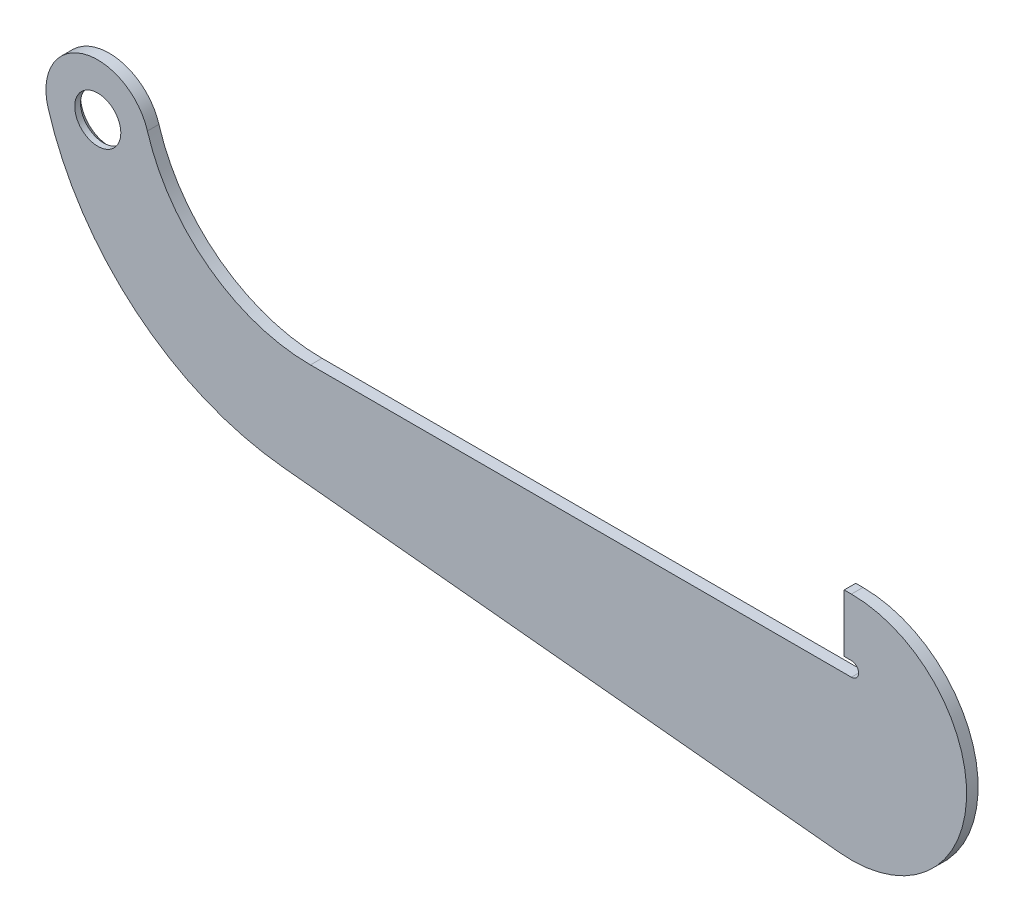
ISO-10303-21;
HEADER;
FILE_DESCRIPTION(('STEP AP214'),'2;1');
FILE_NAME('part.step','',(''),(''),'','','');
FILE_SCHEMA(('AUTOMOTIVE_DESIGN { 1 0 10303 214 1 1 1 1 }'));
ENDSEC;
DATA;
#1=APPLICATION_CONTEXT('core data for automotive mechanical design processes');
#2=APPLICATION_PROTOCOL_DEFINITION('international standard','automotive_design',2000,#1);
#3=PRODUCT_CONTEXT('',#1,'mechanical');
#4=PRODUCT('Part','Part','',(#3));
#5=PRODUCT_RELATED_PRODUCT_CATEGORY('part','',(#4));
#6=PRODUCT_DEFINITION_FORMATION('','',#4);
#7=PRODUCT_DEFINITION_CONTEXT('part definition',#1,'design');
#8=PRODUCT_DEFINITION('design','',#6,#7);
#9=PRODUCT_DEFINITION_SHAPE('','',#8);
#10=(LENGTH_UNIT() NAMED_UNIT(*) SI_UNIT(.MILLI.,.METRE.));
#11=(NAMED_UNIT(*) PLANE_ANGLE_UNIT() SI_UNIT($,.RADIAN.));
#12=(NAMED_UNIT(*) SI_UNIT($,.STERADIAN.) SOLID_ANGLE_UNIT());
#13=UNCERTAINTY_MEASURE_WITH_UNIT(LENGTH_MEASURE(1.E-05),#10,'distance_accuracy_value','');
#14=(GEOMETRIC_REPRESENTATION_CONTEXT(3) GLOBAL_UNCERTAINTY_ASSIGNED_CONTEXT((#13)) GLOBAL_UNIT_ASSIGNED_CONTEXT((#10,
#11,#12)) REPRESENTATION_CONTEXT('',''));
#15=CARTESIAN_POINT('',(0.,0.,0.));
#16=DIRECTION('',(0.,0.,1.));
#17=DIRECTION('',(1.,0.,0.));
#18=AXIS2_PLACEMENT_3D('',#15,#16,#17);
#19=CARTESIAN_POINT('',(261.653254994771,-34.3149545762237,4.));
#20=DIRECTION('',(0.,0.,1.));
#21=DIRECTION('',(1.,0.,0.));
#22=AXIS2_PLACEMENT_3D('',#19,#20,#21);
#23=PLANE('',#22);
#24=DIRECTION('',(0.,-1.,0.));
#25=VECTOR('',#24,1.);
#26=CARTESIAN_POINT('',(259.153254994771,-11.8149545762237,4.));
#27=LINE('',#26,#25);
#28=CARTESIAN_POINT('',(259.153254994771,-11.8149545762237,4.));
#29=VERTEX_POINT('',#28);
#30=CARTESIAN_POINT('',(259.153254994771,-31.8149545762237,4.));
#31=VERTEX_POINT('',#30);
#32=EDGE_CURVE('E167',#29,#31,#27,.T.);
#33=ORIENTED_EDGE('',*,*,#32,.T.);
#34=DIRECTION('',(1.,0.,0.));
#35=VECTOR('',#34,1.);
#36=CARTESIAN_POINT('',(259.153254994771,-31.8149545762237,4.));
#37=LINE('',#36,#35);
#38=CARTESIAN_POINT('',(261.653254994771,-31.8149545762237,4.));
#39=VERTEX_POINT('',#38);
#40=EDGE_CURVE('E105',#31,#39,#37,.T.);
#41=ORIENTED_EDGE('',*,*,#40,.T.);
#42=CARTESIAN_POINT('',(261.653254994771,-34.3149545762237,4.));
#43=DIRECTION('',(0.,0.,-1.));
#44=DIRECTION('',(1.,0.,0.));
#45=AXIS2_PLACEMENT_3D('',#42,#43,#44);
#46=CIRCLE('',#45,2.50000000000001);
#47=CARTESIAN_POINT('',(261.653254994771,-36.8149545762238,4.));
#48=VERTEX_POINT('',#47);
#49=EDGE_CURVE('E250',#39,#48,#46,.T.);
#50=ORIENTED_EDGE('',*,*,#49,.T.);
#51=DIRECTION('',(-1.,0.,0.));
#52=VECTOR('',#51,1.);
#53=CARTESIAN_POINT('',(261.653254994771,-36.8149545762238,4.));
#54=LINE('',#53,#52);
#55=CARTESIAN_POINT('',(73.8381712348275,-36.8149545762238,4.));
#56=VERTEX_POINT('',#55);
#57=EDGE_CURVE('E252',#48,#56,#54,.T.);
#58=ORIENTED_EDGE('',*,*,#57,.T.);
#59=CARTESIAN_POINT('',(73.8381712348275,22.324165960103,4.));
#60=DIRECTION('',(0.,0.,-1.));
#61=DIRECTION('',(-1.,0.,0.));
#62=AXIS2_PLACEMENT_3D('',#59,#60,#61);
#63=CIRCLE('',#62,59.1391205363268);
#64=CARTESIAN_POINT('',(17.2297411869115,5.20922437912188,4.));
#65=VERTEX_POINT('',#64);
#66=EDGE_CURVE('E254',#56,#65,#63,.T.);
#67=ORIENTED_EDGE('',*,*,#66,.T.);
#68=CARTESIAN_POINT('',(-2.77555756156289E-13,0.,4.));
#69=DIRECTION('',(0.,0.,1.));
#70=DIRECTION('',(1.,0.,0.));
#71=AXIS2_PLACEMENT_3D('',#68,#69,#70);
#72=CIRCLE('',#71,18.);
#73=CARTESIAN_POINT('',(-17.229741186912,-5.20922437912183,4.));
#74=VERTEX_POINT('',#73);
#75=EDGE_CURVE('E260',#65,#74,#72,.T.);
#76=ORIENTED_EDGE('',*,*,#75,.T.);
#77=CARTESIAN_POINT('',(73.8381712348275,22.324165960103,4.));
#78=DIRECTION('',(0.,0.,1.));
#79=DIRECTION('',(1.,0.,0.));
#80=AXIS2_PLACEMENT_3D('',#77,#78,#79);
#81=CIRCLE('',#80,95.1391205363269);
#82=CARTESIAN_POINT('',(64.3988822191728,-72.3455339406819,4.));
#83=VERTEX_POINT('',#82);
#84=EDGE_CURVE('E130',#74,#83,#81,.T.);
#85=ORIENTED_EDGE('',*,*,#84,.T.);
#86=DIRECTION('',(0.995065955698395,-0.0992156429704483,0.));
#87=VECTOR('',#86,1.);
#88=CARTESIAN_POINT('',(257.684629275953,-91.6175928041593,4.));
#89=LINE('',#88,#87);
#90=CARTESIAN_POINT('',(257.684629275953,-91.6175928041593,4.));
#91=VERTEX_POINT('',#90);
#92=EDGE_CURVE('E124',#83,#91,#89,.T.);
#93=ORIENTED_EDGE('',*,*,#92,.T.);
#94=CARTESIAN_POINT('',(261.653254994771,-51.8149545762236,4.));
#95=DIRECTION('',(0.,0.,1.));
#96=DIRECTION('',(1.,0.,0.));
#97=AXIS2_PLACEMENT_3D('',#94,#95,#96);
#98=CIRCLE('',#97,39.9999999999999);
#99=CARTESIAN_POINT('',(261.653254994771,-11.8149545762237,4.));
#100=VERTEX_POINT('',#99);
#101=EDGE_CURVE('E128',#91,#100,#98,.T.);
#102=ORIENTED_EDGE('',*,*,#101,.T.);
#103=DIRECTION('',(-1.,0.,0.));
#104=VECTOR('',#103,1.);
#105=CARTESIAN_POINT('',(259.153254994771,-11.8149545762237,4.));
#106=LINE('',#105,#104);
#107=EDGE_CURVE('E55',#100,#29,#106,.T.);
#108=ORIENTED_EDGE('',*,*,#107,.T.);
#109=EDGE_LOOP('',(#33,#41,#50,#58,#67,#76,#85,#93,#102,#108));
#110=FACE_BOUND('',#109,.T.);
#111=CARTESIAN_POINT('',(-2.77555756156289E-13,0.,4.));
#112=DIRECTION('',(0.,0.,1.));
#113=DIRECTION('',(1.,0.,0.));
#114=AXIS2_PLACEMENT_3D('',#111,#112,#113);
#115=CIRCLE('',#114,7.99999999999998);
#116=CARTESIAN_POINT('',(7.99999999999971,0.,4.));
#117=VERTEX_POINT('',#116);
#118=EDGE_CURVE('E152',#117,#117,#115,.T.);
#119=ORIENTED_EDGE('',*,*,#118,.F.);
#120=EDGE_LOOP('',(#119));
#121=FACE_BOUND('',#120,.T.);
#122=ADVANCED_FACE('F38',(#110,#121),#23,.T.);
#123=CARTESIAN_POINT('',(261.653254994771,-34.3149545762237,0.));
#124=DIRECTION('',(0.,0.,1.));
#125=DIRECTION('',(1.,0.,0.));
#126=AXIS2_PLACEMENT_3D('',#123,#124,#125);
#127=PLANE('',#126);
#128=CARTESIAN_POINT('',(-2.77555756156289E-13,0.,0.));
#129=DIRECTION('',(0.,0.,1.));
#130=DIRECTION('',(1.,0.,0.));
#131=AXIS2_PLACEMENT_3D('',#128,#129,#130);
#132=CIRCLE('',#131,9.99999999999995);
#133=CARTESIAN_POINT('',(9.99999999999968,0.,0.));
#134=VERTEX_POINT('',#133);
#135=EDGE_CURVE('E47',#134,#134,#132,.T.);
#136=ORIENTED_EDGE('',*,*,#135,.T.);
#137=EDGE_LOOP('',(#136));
#138=FACE_BOUND('',#137,.T.);
#139=DIRECTION('',(0.,-1.,0.));
#140=VECTOR('',#139,1.);
#141=CARTESIAN_POINT('',(259.153254994771,-11.8149545762237,0.));
#142=LINE('',#141,#140);
#143=CARTESIAN_POINT('',(259.153254994771,-11.8149545762237,0.));
#144=VERTEX_POINT('',#143);
#145=CARTESIAN_POINT('',(259.153254994771,-31.8149545762237,0.));
#146=VERTEX_POINT('',#145);
#147=EDGE_CURVE('E148',#144,#146,#142,.T.);
#148=ORIENTED_EDGE('',*,*,#147,.F.);
#149=DIRECTION('',(-1.,0.,0.));
#150=VECTOR('',#149,1.);
#151=CARTESIAN_POINT('',(259.153254994771,-11.8149545762237,0.));
#152=LINE('',#151,#150);
#153=CARTESIAN_POINT('',(261.653254994771,-11.8149545762237,0.));
#154=VERTEX_POINT('',#153);
#155=EDGE_CURVE('E96',#154,#144,#152,.T.);
#156=ORIENTED_EDGE('',*,*,#155,.F.);
#157=CARTESIAN_POINT('',(261.653254994771,-51.8149545762236,0.));
#158=DIRECTION('',(0.,0.,1.));
#159=DIRECTION('',(1.,0.,0.));
#160=AXIS2_PLACEMENT_3D('',#157,#158,#159);
#161=CIRCLE('',#160,39.9999999999999);
#162=CARTESIAN_POINT('',(257.684629275953,-91.6175928041593,0.));
#163=VERTEX_POINT('',#162);
#164=EDGE_CURVE('E90',#163,#154,#161,.T.);
#165=ORIENTED_EDGE('',*,*,#164,.F.);
#166=DIRECTION('',(0.995065955698395,-0.0992156429704483,0.));
#167=VECTOR('',#166,1.);
#168=CARTESIAN_POINT('',(257.684629275953,-91.6175928041593,0.));
#169=LINE('',#168,#167);
#170=CARTESIAN_POINT('',(64.3988822191728,-72.3455339406819,0.));
#171=VERTEX_POINT('',#170);
#172=EDGE_CURVE('E138',#171,#163,#169,.T.);
#173=ORIENTED_EDGE('',*,*,#172,.F.);
#174=CARTESIAN_POINT('',(73.8381712348275,22.324165960103,0.));
#175=DIRECTION('',(0.,0.,1.));
#176=DIRECTION('',(1.,0.,0.));
#177=AXIS2_PLACEMENT_3D('',#174,#175,#176);
#178=CIRCLE('',#177,95.1391205363269);
#179=CARTESIAN_POINT('',(-17.229741186912,-5.20922437912183,0.));
#180=VERTEX_POINT('',#179);
#181=EDGE_CURVE('E162',#180,#171,#178,.T.);
#182=ORIENTED_EDGE('',*,*,#181,.F.);
#183=CARTESIAN_POINT('',(-2.77555756156289E-13,0.,0.));
#184=DIRECTION('',(0.,0.,1.));
#185=DIRECTION('',(1.,0.,0.));
#186=AXIS2_PLACEMENT_3D('',#183,#184,#185);
#187=CIRCLE('',#186,18.);
#188=CARTESIAN_POINT('',(17.2297411869115,5.20922437912188,0.));
#189=VERTEX_POINT('',#188);
#190=EDGE_CURVE('E160',#189,#180,#187,.T.);
#191=ORIENTED_EDGE('',*,*,#190,.F.);
#192=CARTESIAN_POINT('',(73.8381712348275,22.324165960103,0.));
#193=DIRECTION('',(0.,0.,-1.));
#194=DIRECTION('',(-1.,0.,0.));
#195=AXIS2_PLACEMENT_3D('',#192,#193,#194);
#196=CIRCLE('',#195,59.1391205363268);
#197=CARTESIAN_POINT('',(73.8381712348275,-36.8149545762238,0.));
#198=VERTEX_POINT('',#197);
#199=EDGE_CURVE('E158',#198,#189,#196,.T.);
#200=ORIENTED_EDGE('',*,*,#199,.F.);
#201=DIRECTION('',(-1.,0.,0.));
#202=VECTOR('',#201,1.);
#203=CARTESIAN_POINT('',(261.653254994771,-36.8149545762238,0.));
#204=LINE('',#203,#202);
#205=CARTESIAN_POINT('',(261.653254994771,-36.8149545762238,0.));
#206=VERTEX_POINT('',#205);
#207=EDGE_CURVE('E156',#206,#198,#204,.T.);
#208=ORIENTED_EDGE('',*,*,#207,.F.);
#209=CARTESIAN_POINT('',(261.653254994771,-34.3149545762237,0.));
#210=DIRECTION('',(0.,0.,-1.));
#211=DIRECTION('',(1.,0.,0.));
#212=AXIS2_PLACEMENT_3D('',#209,#210,#211);
#213=CIRCLE('',#212,2.50000000000001);
#214=CARTESIAN_POINT('',(261.653254994771,-31.8149545762237,0.));
#215=VERTEX_POINT('',#214);
#216=EDGE_CURVE('E154',#215,#206,#213,.T.);
#217=ORIENTED_EDGE('',*,*,#216,.F.);
#218=DIRECTION('',(1.,0.,0.));
#219=VECTOR('',#218,1.);
#220=CARTESIAN_POINT('',(259.153254994771,-31.8149545762237,0.));
#221=LINE('',#220,#219);
#222=EDGE_CURVE('E151',#146,#215,#221,.T.);
#223=ORIENTED_EDGE('',*,*,#222,.F.);
#224=EDGE_LOOP('',(#148,#156,#165,#173,#182,#191,#200,#208,#217,#223));
#225=FACE_BOUND('',#224,.T.);
#226=ADVANCED_FACE('F190',(#138,#225),#127,.F.);
#227=CARTESIAN_POINT('',(259.153254994771,-11.8149545762237,4.));
#228=DIRECTION('',(1.,0.,0.));
#229=DIRECTION('',(0.,0.,-1.));
#230=AXIS2_PLACEMENT_3D('',#227,#228,#229);
#231=PLANE('',#230);
#232=ORIENTED_EDGE('',*,*,#147,.T.);
#233=DIRECTION('',(0.,0.,-1.));
#234=VECTOR('',#233,1.);
#235=CARTESIAN_POINT('',(259.153254994771,-31.8149545762237,4.));
#236=LINE('',#235,#234);
#237=EDGE_CURVE('E186',#31,#146,#236,.T.);
#238=ORIENTED_EDGE('',*,*,#237,.F.);
#239=ORIENTED_EDGE('',*,*,#32,.F.);
#240=DIRECTION('',(0.,0.,-1.));
#241=VECTOR('',#240,1.);
#242=CARTESIAN_POINT('',(259.153254994771,-11.8149545762237,4.));
#243=LINE('',#242,#241);
#244=EDGE_CURVE('E144',#29,#144,#243,.T.);
#245=ORIENTED_EDGE('',*,*,#244,.T.);
#246=EDGE_LOOP('',(#232,#238,#239,#245));
#247=FACE_BOUND('',#246,.T.);
#248=ADVANCED_FACE('F208',(#247),#231,.F.);
#249=CARTESIAN_POINT('',(259.153254994771,-31.8149545762237,4.));
#250=DIRECTION('',(0.,1.,0.));
#251=DIRECTION('',(-1.,0.,0.));
#252=AXIS2_PLACEMENT_3D('',#249,#250,#251);
#253=PLANE('',#252);
#254=ORIENTED_EDGE('',*,*,#222,.T.);
#255=DIRECTION('',(0.,0.,-1.));
#256=VECTOR('',#255,1.);
#257=CARTESIAN_POINT('',(261.653254994771,-31.8149545762237,4.));
#258=LINE('',#257,#256);
#259=EDGE_CURVE('E183',#39,#215,#258,.T.);
#260=ORIENTED_EDGE('',*,*,#259,.F.);
#261=ORIENTED_EDGE('',*,*,#40,.F.);
#262=ORIENTED_EDGE('',*,*,#237,.T.);
#263=EDGE_LOOP('',(#254,#260,#261,#262));
#264=FACE_BOUND('',#263,.T.);
#265=ADVANCED_FACE('F236',(#264),#253,.F.);
#266=CARTESIAN_POINT('',(261.653254994771,-34.3149545762237,4.));
#267=DIRECTION('',(0.,0.,-1.));
#268=DIRECTION('',(-1.,0.,0.));
#269=AXIS2_PLACEMENT_3D('',#266,#267,#268);
#270=CYLINDRICAL_SURFACE('',#269,2.50000000000001);
#271=ORIENTED_EDGE('',*,*,#216,.T.);
#272=DIRECTION('',(0.,0.,-1.));
#273=VECTOR('',#272,1.);
#274=CARTESIAN_POINT('',(261.653254994771,-36.8149545762238,4.));
#275=LINE('',#274,#273);
#276=EDGE_CURVE('E180',#48,#206,#275,.T.);
#277=ORIENTED_EDGE('',*,*,#276,.F.);
#278=ORIENTED_EDGE('',*,*,#49,.F.);
#279=ORIENTED_EDGE('',*,*,#259,.T.);
#280=EDGE_LOOP('',(#271,#277,#278,#279));
#281=FACE_BOUND('',#280,.T.);
#282=ADVANCED_FACE('F232',(#281),#270,.F.);
#283=CARTESIAN_POINT('',(261.653254994771,-36.8149545762238,4.));
#284=DIRECTION('',(0.,-1.,0.));
#285=DIRECTION('',(1.,0.,0.));
#286=AXIS2_PLACEMENT_3D('',#283,#284,#285);
#287=PLANE('',#286);
#288=ORIENTED_EDGE('',*,*,#207,.T.);
#289=DIRECTION('',(0.,0.,-1.));
#290=VECTOR('',#289,1.);
#291=CARTESIAN_POINT('',(73.8381712348275,-36.8149545762238,4.));
#292=LINE('',#291,#290);
#293=EDGE_CURVE('E177',#56,#198,#292,.T.);
#294=ORIENTED_EDGE('',*,*,#293,.F.);
#295=ORIENTED_EDGE('',*,*,#57,.F.);
#296=ORIENTED_EDGE('',*,*,#276,.T.);
#297=EDGE_LOOP('',(#288,#294,#295,#296));
#298=FACE_BOUND('',#297,.T.);
#299=ADVANCED_FACE('F228',(#298),#287,.F.);
#300=CARTESIAN_POINT('',(73.8381712348275,22.324165960103,4.));
#301=DIRECTION('',(0.,0.,-1.));
#302=DIRECTION('',(-1.,0.,0.));
#303=AXIS2_PLACEMENT_3D('',#300,#301,#302);
#304=CYLINDRICAL_SURFACE('',#303,59.1391205363268);
#305=ORIENTED_EDGE('',*,*,#199,.T.);
#306=DIRECTION('',(0.,0.,-1.));
#307=VECTOR('',#306,1.);
#308=CARTESIAN_POINT('',(17.2297411869115,5.20922437912188,4.));
#309=LINE('',#308,#307);
#310=EDGE_CURVE('E174',#65,#189,#309,.T.);
#311=ORIENTED_EDGE('',*,*,#310,.F.);
#312=ORIENTED_EDGE('',*,*,#66,.F.);
#313=ORIENTED_EDGE('',*,*,#293,.T.);
#314=EDGE_LOOP('',(#305,#311,#312,#313));
#315=FACE_BOUND('',#314,.T.);
#316=ADVANCED_FACE('F224',(#315),#304,.F.);
#317=CARTESIAN_POINT('',(-2.77555756156289E-13,0.,4.));
#318=DIRECTION('',(0.,0.,-1.));
#319=DIRECTION('',(-1.,0.,0.));
#320=AXIS2_PLACEMENT_3D('',#317,#318,#319);
#321=CYLINDRICAL_SURFACE('',#320,18.);
#322=ORIENTED_EDGE('',*,*,#190,.T.);
#323=DIRECTION('',(0.,0.,-1.));
#324=VECTOR('',#323,1.);
#325=CARTESIAN_POINT('',(-17.229741186912,-5.20922437912183,4.));
#326=LINE('',#325,#324);
#327=EDGE_CURVE('E171',#74,#180,#326,.T.);
#328=ORIENTED_EDGE('',*,*,#327,.F.);
#329=ORIENTED_EDGE('',*,*,#75,.F.);
#330=ORIENTED_EDGE('',*,*,#310,.T.);
#331=EDGE_LOOP('',(#322,#328,#329,#330));
#332=FACE_BOUND('',#331,.T.);
#333=ADVANCED_FACE('F220',(#332),#321,.T.);
#334=CARTESIAN_POINT('',(73.8381712348275,22.324165960103,4.));
#335=DIRECTION('',(0.,0.,-1.));
#336=DIRECTION('',(-1.,0.,0.));
#337=AXIS2_PLACEMENT_3D('',#334,#335,#336);
#338=CYLINDRICAL_SURFACE('',#337,95.1391205363269);
#339=ORIENTED_EDGE('',*,*,#181,.T.);
#340=DIRECTION('',(0.,0.,-1.));
#341=VECTOR('',#340,1.);
#342=CARTESIAN_POINT('',(64.3988822191728,-72.3455339406819,4.));
#343=LINE('',#342,#341);
#344=EDGE_CURVE('E139',#83,#171,#343,.T.);
#345=ORIENTED_EDGE('',*,*,#344,.F.);
#346=ORIENTED_EDGE('',*,*,#84,.F.);
#347=ORIENTED_EDGE('',*,*,#327,.T.);
#348=EDGE_LOOP('',(#339,#345,#346,#347));
#349=FACE_BOUND('',#348,.T.);
#350=ADVANCED_FACE('F217',(#349),#338,.T.);
#351=CARTESIAN_POINT('',(257.684629275953,-91.6175928041593,4.));
#352=DIRECTION('',(0.0992156429704483,0.995065955698395,0.));
#353=DIRECTION('',(-0.995065955698395,0.0992156429704483,0.));
#354=AXIS2_PLACEMENT_3D('',#351,#352,#353);
#355=PLANE('',#354);
#356=ORIENTED_EDGE('',*,*,#172,.T.);
#357=DIRECTION('',(0.,0.,-1.));
#358=VECTOR('',#357,1.);
#359=CARTESIAN_POINT('',(257.684629275953,-91.6175928041593,4.));
#360=LINE('',#359,#358);
#361=EDGE_CURVE('E135',#91,#163,#360,.T.);
#362=ORIENTED_EDGE('',*,*,#361,.F.);
#363=ORIENTED_EDGE('',*,*,#92,.F.);
#364=ORIENTED_EDGE('',*,*,#344,.T.);
#365=EDGE_LOOP('',(#356,#362,#363,#364));
#366=FACE_BOUND('',#365,.T.);
#367=ADVANCED_FACE('F136',(#366),#355,.F.);
#368=CARTESIAN_POINT('',(261.653254994771,-51.8149545762236,4.));
#369=DIRECTION('',(0.,0.,-1.));
#370=DIRECTION('',(-1.,0.,0.));
#371=AXIS2_PLACEMENT_3D('',#368,#369,#370);
#372=CYLINDRICAL_SURFACE('',#371,39.9999999999999);
#373=ORIENTED_EDGE('',*,*,#164,.T.);
#374=DIRECTION('',(0.,0.,-1.));
#375=VECTOR('',#374,1.);
#376=CARTESIAN_POINT('',(261.653254994771,-11.8149545762237,4.));
#377=LINE('',#376,#375);
#378=EDGE_CURVE('E140',#100,#154,#377,.T.);
#379=ORIENTED_EDGE('',*,*,#378,.F.);
#380=ORIENTED_EDGE('',*,*,#101,.F.);
#381=ORIENTED_EDGE('',*,*,#361,.T.);
#382=EDGE_LOOP('',(#373,#379,#380,#381));
#383=FACE_BOUND('',#382,.T.);
#384=ADVANCED_FACE('F142',(#383),#372,.T.);
#385=CARTESIAN_POINT('',(259.153254994771,-11.8149545762237,4.));
#386=DIRECTION('',(0.,-1.,0.));
#387=DIRECTION('',(0.,0.,-1.));
#388=AXIS2_PLACEMENT_3D('',#385,#386,#387);
#389=PLANE('',#388);
#390=ORIENTED_EDGE('',*,*,#155,.T.);
#391=ORIENTED_EDGE('',*,*,#244,.F.);
#392=ORIENTED_EDGE('',*,*,#107,.F.);
#393=ORIENTED_EDGE('',*,*,#378,.T.);
#394=EDGE_LOOP('',(#390,#391,#392,#393));
#395=FACE_BOUND('',#394,.T.);
#396=ADVANCED_FACE('F199',(#395),#389,.F.);
#397=CARTESIAN_POINT('',(-2.77555756156289E-13,0.,4.));
#398=DIRECTION('',(0.,0.,-1.));
#399=DIRECTION('',(-1.,0.,0.));
#400=AXIS2_PLACEMENT_3D('',#397,#398,#399);
#401=CYLINDRICAL_SURFACE('',#400,7.99999999999998);
#402=CARTESIAN_POINT('',(-2.77555756156289E-13,0.,1.99999999999997));
#403=DIRECTION('',(0.,0.,1.));
#404=DIRECTION('',(1.,0.,0.));
#405=AXIS2_PLACEMENT_3D('',#402,#403,#404);
#406=CIRCLE('',#405,7.99999999999998);
#407=CARTESIAN_POINT('',(7.99999999999971,0.,1.99999999999997));
#408=VERTEX_POINT('',#407);
#409=EDGE_CURVE('E11',#408,#408,#406,.F.);
#410=ORIENTED_EDGE('',*,*,#409,.T.);
#411=EDGE_LOOP('',(#410));
#412=FACE_BOUND('',#411,.T.);
#413=ORIENTED_EDGE('',*,*,#118,.T.);
#414=EDGE_LOOP('',(#413));
#415=FACE_BOUND('',#414,.T.);
#416=ADVANCED_FACE('F194',(#412,#415),#401,.F.);
#417=CARTESIAN_POINT('',(-2.77555756156289E-13,0.,0.));
#418=DIRECTION('',(0.,0.,-1.));
#419=DIRECTION('',(-1.,0.,0.));
#420=AXIS2_PLACEMENT_3D('',#417,#418,#419);
#421=CONICAL_SURFACE('',#420,9.99999999999995,0.785398163397448);
#422=ORIENTED_EDGE('',*,*,#409,.F.);
#423=EDGE_LOOP('',(#422));
#424=FACE_BOUND('',#423,.T.);
#425=ORIENTED_EDGE('',*,*,#135,.F.);
#426=EDGE_LOOP('',(#425));
#427=FACE_BOUND('',#426,.T.);
#428=ADVANCED_FACE('F40',(#424,#427),#421,.F.);
#429=CLOSED_SHELL('',(#122,#226,#248,#265,#282,#299,#316,#333,#350,#367,#384,#396,#416,#428));
#430=MANIFOLD_SOLID_BREP('B2',#429);
#431=ADVANCED_BREP_SHAPE_REPRESENTATION('',(#18,#430),#14);
#432=SHAPE_DEFINITION_REPRESENTATION(#9,#431);
ENDSEC;
END-ISO-10303-21;
